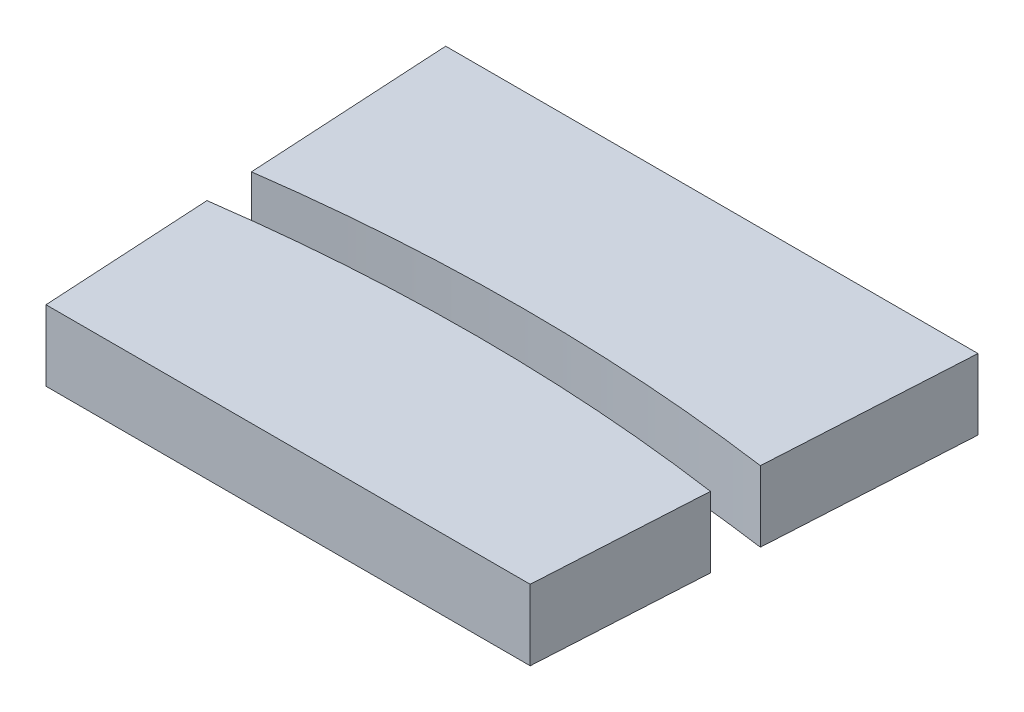
ISO-10303-21;
HEADER;
FILE_DESCRIPTION(('STEP AP214'),'2;1');
FILE_NAME('part.step','',(''),(''),'','','');
FILE_SCHEMA(('AUTOMOTIVE_DESIGN { 1 0 10303 214 1 1 1 1 }'));
ENDSEC;
DATA;
#1=APPLICATION_CONTEXT('core data for automotive mechanical design processes');
#2=APPLICATION_PROTOCOL_DEFINITION('international standard','automotive_design',2000,#1);
#3=PRODUCT_CONTEXT('',#1,'mechanical');
#4=PRODUCT('Part','Part','',(#3));
#5=PRODUCT_RELATED_PRODUCT_CATEGORY('part','',(#4));
#6=PRODUCT_DEFINITION_FORMATION('','',#4);
#7=PRODUCT_DEFINITION_CONTEXT('part definition',#1,'design');
#8=PRODUCT_DEFINITION('design','',#6,#7);
#9=PRODUCT_DEFINITION_SHAPE('','',#8);
#10=(LENGTH_UNIT() NAMED_UNIT(*) SI_UNIT(.MILLI.,.METRE.));
#11=(NAMED_UNIT(*) PLANE_ANGLE_UNIT() SI_UNIT($,.RADIAN.));
#12=(NAMED_UNIT(*) SI_UNIT($,.STERADIAN.) SOLID_ANGLE_UNIT());
#13=UNCERTAINTY_MEASURE_WITH_UNIT(LENGTH_MEASURE(1.E-05),#10,'distance_accuracy_value','');
#14=(GEOMETRIC_REPRESENTATION_CONTEXT(3) GLOBAL_UNCERTAINTY_ASSIGNED_CONTEXT((#13)) GLOBAL_UNIT_ASSIGNED_CONTEXT((#10,
#11,#12)) REPRESENTATION_CONTEXT('',''));
#15=CARTESIAN_POINT('',(0.,0.,0.));
#16=DIRECTION('',(0.,0.,1.));
#17=DIRECTION('',(1.,0.,0.));
#18=AXIS2_PLACEMENT_3D('',#15,#16,#17);
#19=CARTESIAN_POINT('',(-11.5899552235731,3.,-91.5));
#20=DIRECTION('',(0.998391670557349,0.,-0.0566927875633778));
#21=DIRECTION('',(-0.0566927875633778,0.,-0.998391670557349));
#22=AXIS2_PLACEMENT_3D('',#19,#20,#21);
#23=PLANE('',#22);
#24=DIRECTION('',(0.0566927875633778,0.,0.998391670557349));
#25=VECTOR('',#24,1.);
#26=CARTESIAN_POINT('',(-11.5899552235731,0.,-91.5));
#27=LINE('',#26,#25);
#28=CARTESIAN_POINT('',(-11.3060346479351,0.,-86.5));
#29=VERTEX_POINT('',#28);
#30=CARTESIAN_POINT('',(-10.8093001813665,0.,-77.7522284541678));
#31=VERTEX_POINT('',#30);
#32=EDGE_CURVE('E102',#29,#31,#27,.T.);
#33=ORIENTED_EDGE('',*,*,#32,.T.);
#34=DIRECTION('',(0.,1.,0.));
#35=VECTOR('',#34,1.);
#36=CARTESIAN_POINT('',(-10.8093001813665,0.,-77.7522284541679));
#37=LINE('',#36,#35);
#38=CARTESIAN_POINT('',(-10.8093001813665,3.,-77.7522284541678));
#39=VERTEX_POINT('',#38);
#40=EDGE_CURVE('E58',#31,#39,#37,.T.);
#41=ORIENTED_EDGE('',*,*,#40,.T.);
#42=DIRECTION('',(0.0566927875633778,0.,0.998391670557349));
#43=VECTOR('',#42,1.);
#44=CARTESIAN_POINT('',(-11.5899552235731,3.,-91.5));
#45=LINE('',#44,#43);
#46=CARTESIAN_POINT('',(-11.3060346479351,3.,-86.5));
#47=VERTEX_POINT('',#46);
#48=EDGE_CURVE('E104',#47,#39,#45,.T.);
#49=ORIENTED_EDGE('',*,*,#48,.F.);
#50=DIRECTION('',(0.,1.,0.));
#51=VECTOR('',#50,1.);
#52=CARTESIAN_POINT('',(-11.3060346479351,0.,-86.5));
#53=LINE('',#52,#51);
#54=EDGE_CURVE('E50',#29,#47,#53,.T.);
#55=ORIENTED_EDGE('',*,*,#54,.F.);
#56=EDGE_LOOP('',(#33,#41,#49,#55));
#57=FACE_BOUND('',#56,.T.);
#58=ADVANCED_FACE('F42',(#57),#23,.F.);
#59=CARTESIAN_POINT('',(0.,3.,0.));
#60=DIRECTION('',(0.,-1.,0.));
#61=DIRECTION('',(0.,0.,-1.));
#62=AXIS2_PLACEMENT_3D('',#59,#60,#61);
#63=PLANE('',#62);
#64=ORIENTED_EDGE('',*,*,#48,.T.);
#65=CARTESIAN_POINT('',(0.,3.,0.));
#66=DIRECTION('',(0.,-1.,0.));
#67=DIRECTION('',(0.,0.,-1.));
#68=AXIS2_PLACEMENT_3D('',#65,#66,#67);
#69=CIRCLE('',#68,78.5);
#70=CARTESIAN_POINT('',(10.8093001813665,3.000006,-77.7522284541678));
#71=VERTEX_POINT('',#70);
#72=EDGE_CURVE('E62',#39,#71,#69,.T.);
#73=ORIENTED_EDGE('',*,*,#72,.T.);
#74=DIRECTION('',(-0.0566927875633778,0.,0.998391670557349));
#75=VECTOR('',#74,1.);
#76=CARTESIAN_POINT('',(11.5899552235731,3.,-91.5));
#77=LINE('',#76,#75);
#78=CARTESIAN_POINT('',(11.3060346479351,3.,-86.5));
#79=VERTEX_POINT('',#78);
#80=EDGE_CURVE('E95',#79,#71,#77,.T.);
#81=ORIENTED_EDGE('',*,*,#80,.F.);
#82=DIRECTION('',(-1.,0.,0.));
#83=VECTOR('',#82,1.);
#84=CARTESIAN_POINT('',(0.,3.,-86.5));
#85=LINE('',#84,#83);
#86=EDGE_CURVE('E86',#79,#47,#85,.T.);
#87=ORIENTED_EDGE('',*,*,#86,.T.);
#88=EDGE_LOOP('',(#64,#73,#81,#87));
#89=FACE_BOUND('',#88,.T.);
#90=ADVANCED_FACE('F121',(#89),#63,.F.);
#91=CARTESIAN_POINT('',(0.,0.,0.));
#92=DIRECTION('',(0.,-1.,0.));
#93=DIRECTION('',(0.,0.,-1.));
#94=AXIS2_PLACEMENT_3D('',#91,#92,#93);
#95=PLANE('',#94);
#96=CARTESIAN_POINT('',(0.,0.,0.));
#97=DIRECTION('',(0.,1.,0.));
#98=DIRECTION('',(0.,0.,-1.));
#99=AXIS2_PLACEMENT_3D('',#96,#97,#98);
#100=CIRCLE('',#99,78.5);
#101=CARTESIAN_POINT('',(10.8093001813665,0.,-77.7522284541678));
#102=VERTEX_POINT('',#101);
#103=EDGE_CURVE('E78',#102,#31,#100,.T.);
#104=ORIENTED_EDGE('',*,*,#103,.T.);
#105=ORIENTED_EDGE('',*,*,#32,.F.);
#106=DIRECTION('',(1.,0.,0.));
#107=VECTOR('',#106,1.);
#108=CARTESIAN_POINT('',(0.,0.,-86.5));
#109=LINE('',#108,#107);
#110=CARTESIAN_POINT('',(11.3060346479351,0.,-86.5));
#111=VERTEX_POINT('',#110);
#112=EDGE_CURVE('E85',#29,#111,#109,.T.);
#113=ORIENTED_EDGE('',*,*,#112,.T.);
#114=DIRECTION('',(-0.0566927875633778,0.,0.998391670557349));
#115=VECTOR('',#114,1.);
#116=CARTESIAN_POINT('',(11.5899552235731,0.,-91.5));
#117=LINE('',#116,#115);
#118=EDGE_CURVE('E93',#111,#102,#117,.T.);
#119=ORIENTED_EDGE('',*,*,#118,.T.);
#120=EDGE_LOOP('',(#104,#105,#113,#119));
#121=FACE_BOUND('',#120,.T.);
#122=ADVANCED_FACE('F96',(#121),#95,.T.);
#123=CARTESIAN_POINT('',(11.5899552235731,3.,-91.5));
#124=DIRECTION('',(-0.998391670557349,0.,-0.0566927875633778));
#125=DIRECTION('',(0.0566927875633778,0.,-0.998391670557349));
#126=AXIS2_PLACEMENT_3D('',#123,#124,#125);
#127=PLANE('',#126);
#128=ORIENTED_EDGE('',*,*,#80,.T.);
#129=DIRECTION('',(0.,1.,0.));
#130=VECTOR('',#129,1.);
#131=CARTESIAN_POINT('',(10.8093001813665,0.,-77.7522284541678));
#132=LINE('',#131,#130);
#133=EDGE_CURVE('E12',#102,#71,#132,.T.);
#134=ORIENTED_EDGE('',*,*,#133,.F.);
#135=ORIENTED_EDGE('',*,*,#118,.F.);
#136=DIRECTION('',(0.,1.,0.));
#137=VECTOR('',#136,1.);
#138=CARTESIAN_POINT('',(11.3060346479351,0.,-86.5));
#139=LINE('',#138,#137);
#140=EDGE_CURVE('E98',#111,#79,#139,.T.);
#141=ORIENTED_EDGE('',*,*,#140,.T.);
#142=EDGE_LOOP('',(#128,#134,#135,#141));
#143=FACE_BOUND('',#142,.T.);
#144=ADVANCED_FACE('F91',(#143),#127,.F.);
#145=CARTESIAN_POINT('',(0.,0.,-86.5));
#146=DIRECTION('',(0.,0.,1.));
#147=DIRECTION('',(1.,0.,0.));
#148=AXIS2_PLACEMENT_3D('',#145,#146,#147);
#149=PLANE('',#148);
#150=ORIENTED_EDGE('',*,*,#86,.F.);
#151=ORIENTED_EDGE('',*,*,#140,.F.);
#152=ORIENTED_EDGE('',*,*,#112,.F.);
#153=ORIENTED_EDGE('',*,*,#54,.T.);
#154=EDGE_LOOP('',(#150,#151,#152,#153));
#155=FACE_BOUND('',#154,.T.);
#156=ADVANCED_FACE('F118',(#155),#149,.F.);
#157=CARTESIAN_POINT('',(0.,0.,0.));
#158=DIRECTION('',(0.,1.,0.));
#159=DIRECTION('',(0.,0.,1.));
#160=AXIS2_PLACEMENT_3D('',#157,#158,#159);
#161=CYLINDRICAL_SURFACE('',#160,78.5);
#162=ORIENTED_EDGE('',*,*,#103,.F.);
#163=ORIENTED_EDGE('',*,*,#133,.T.);
#164=ORIENTED_EDGE('',*,*,#72,.F.);
#165=ORIENTED_EDGE('',*,*,#40,.F.);
#166=EDGE_LOOP('',(#162,#163,#164,#165));
#167=FACE_BOUND('',#166,.T.);
#168=ADVANCED_FACE('F80',(#167),#161,.F.);
#169=CLOSED_SHELL('',(#58,#90,#122,#144,#156,#168));
#170=MANIFOLD_SOLID_BREP('B2',#169);
#171=CARTESIAN_POINT('',(-10.2839205756381,0.,-68.5));
#172=DIRECTION('',(0.,0.,-1.));
#173=DIRECTION('',(-1.,0.,0.));
#174=AXIS2_PLACEMENT_3D('',#171,#172,#173);
#175=PLANE('',#174);
#176=DIRECTION('',(0.,1.,0.));
#177=VECTOR('',#176,1.);
#178=CARTESIAN_POINT('',(-10.2839205756381,0.,-68.5));
#179=LINE('',#178,#177);
#180=CARTESIAN_POINT('',(-10.2839205756381,0.,-68.5));
#181=VERTEX_POINT('',#180);
#182=CARTESIAN_POINT('',(-10.2839205756381,3.,-68.5));
#183=VERTEX_POINT('',#182);
#184=EDGE_CURVE('E239',#181,#183,#179,.T.);
#185=ORIENTED_EDGE('',*,*,#184,.F.);
#186=DIRECTION('',(-1.,0.,0.));
#187=VECTOR('',#186,1.);
#188=CARTESIAN_POINT('',(-10.2839205756381,0.,-68.5));
#189=LINE('',#188,#187);
#190=CARTESIAN_POINT('',(10.2839205756381,0.,-68.5));
#191=VERTEX_POINT('',#190);
#192=EDGE_CURVE('E229',#191,#181,#189,.T.);
#193=ORIENTED_EDGE('',*,*,#192,.F.);
#194=DIRECTION('',(0.,1.,0.));
#195=VECTOR('',#194,1.);
#196=CARTESIAN_POINT('',(10.2839205756381,0.,-68.5));
#197=LINE('',#196,#195);
#198=CARTESIAN_POINT('',(10.2839205756381,3.,-68.5));
#199=VERTEX_POINT('',#198);
#200=EDGE_CURVE('E234',#191,#199,#197,.T.);
#201=ORIENTED_EDGE('',*,*,#200,.T.);
#202=DIRECTION('',(1.,0.,0.));
#203=VECTOR('',#202,1.);
#204=CARTESIAN_POINT('',(0.,3.,-68.5));
#205=LINE('',#204,#203);
#206=EDGE_CURVE('E250',#183,#199,#205,.T.);
#207=ORIENTED_EDGE('',*,*,#206,.F.);
#208=EDGE_LOOP('',(#185,#193,#201,#207));
#209=FACE_BOUND('',#208,.T.);
#210=ADVANCED_FACE('F181',(#209),#175,.F.);
#211=CARTESIAN_POINT('',(11.5899552235731,3.,-91.5));
#212=DIRECTION('',(-0.998391670557349,0.,-0.0566927875633778));
#213=DIRECTION('',(0.0566927875633778,0.,-0.998391670557349));
#214=AXIS2_PLACEMENT_3D('',#211,#212,#213);
#215=PLANE('',#214);
#216=DIRECTION('',(-0.0566927875633778,0.,0.998391670557349));
#217=VECTOR('',#216,1.);
#218=CARTESIAN_POINT('',(11.5899552235731,0.,-91.5));
#219=LINE('',#218,#217);
#220=CARTESIAN_POINT('',(10.6955278920303,0.,-75.7486348597174));
#221=VERTEX_POINT('',#220);
#222=EDGE_CURVE('E226',#221,#191,#219,.T.);
#223=ORIENTED_EDGE('',*,*,#222,.F.);
#224=DIRECTION('',(0.,1.,0.));
#225=VECTOR('',#224,1.);
#226=CARTESIAN_POINT('',(10.6955278920303,0.,-75.7486348597174));
#227=LINE('',#226,#225);
#228=CARTESIAN_POINT('',(10.6955278920303,3.,-75.7486348597174));
#229=VERTEX_POINT('',#228);
#230=EDGE_CURVE('E219',#221,#229,#227,.T.);
#231=ORIENTED_EDGE('',*,*,#230,.T.);
#232=DIRECTION('',(-0.0566927875633778,0.,0.998391670557349));
#233=VECTOR('',#232,1.);
#234=CARTESIAN_POINT('',(11.5899552235731,3.,-91.5));
#235=LINE('',#234,#233);
#236=EDGE_CURVE('E233',#229,#199,#235,.T.);
#237=ORIENTED_EDGE('',*,*,#236,.T.);
#238=ORIENTED_EDGE('',*,*,#200,.F.);
#239=EDGE_LOOP('',(#223,#231,#237,#238));
#240=FACE_BOUND('',#239,.T.);
#241=ADVANCED_FACE('F241',(#240),#215,.F.);
#242=CARTESIAN_POINT('',(0.,0.,0.));
#243=DIRECTION('',(0.,-1.,0.));
#244=DIRECTION('',(0.,0.,-1.));
#245=AXIS2_PLACEMENT_3D('',#242,#243,#244);
#246=PLANE('',#245);
#247=CARTESIAN_POINT('',(0.,0.,0.));
#248=DIRECTION('',(0.,-1.,0.));
#249=DIRECTION('',(0.,0.,-1.));
#250=AXIS2_PLACEMENT_3D('',#247,#248,#249);
#251=CIRCLE('',#250,76.5);
#252=CARTESIAN_POINT('',(-10.6955278920303,0.,-75.7486348597175));
#253=VERTEX_POINT('',#252);
#254=EDGE_CURVE('E230',#253,#221,#251,.T.);
#255=ORIENTED_EDGE('',*,*,#254,.T.);
#256=ORIENTED_EDGE('',*,*,#222,.T.);
#257=ORIENTED_EDGE('',*,*,#192,.T.);
#258=DIRECTION('',(0.0566927875633778,0.,0.998391670557349));
#259=VECTOR('',#258,1.);
#260=CARTESIAN_POINT('',(-11.5899552235731,0.,-91.5));
#261=LINE('',#260,#259);
#262=EDGE_CURVE('E190',#253,#181,#261,.T.);
#263=ORIENTED_EDGE('',*,*,#262,.F.);
#264=EDGE_LOOP('',(#255,#256,#257,#263));
#265=FACE_BOUND('',#264,.T.);
#266=ADVANCED_FACE('F228',(#265),#246,.T.);
#267=CARTESIAN_POINT('',(0.,3.,0.));
#268=DIRECTION('',(0.,-1.,0.));
#269=DIRECTION('',(0.,0.,-1.));
#270=AXIS2_PLACEMENT_3D('',#267,#268,#269);
#271=PLANE('',#270);
#272=ORIENTED_EDGE('',*,*,#236,.F.);
#273=CARTESIAN_POINT('',(0.,3.,0.));
#274=DIRECTION('',(0.,1.,0.));
#275=DIRECTION('',(0.,0.,1.));
#276=AXIS2_PLACEMENT_3D('',#273,#274,#275);
#277=CIRCLE('',#276,76.5);
#278=CARTESIAN_POINT('',(-10.6955278920303,3.,-75.7486348597174));
#279=VERTEX_POINT('',#278);
#280=EDGE_CURVE('E185',#279,#229,#277,.F.);
#281=ORIENTED_EDGE('',*,*,#280,.F.);
#282=DIRECTION('',(0.0566927875633778,0.,0.998391670557349));
#283=VECTOR('',#282,1.);
#284=CARTESIAN_POINT('',(-11.5899552235731,3.,-91.5));
#285=LINE('',#284,#283);
#286=EDGE_CURVE('E40',#279,#183,#285,.T.);
#287=ORIENTED_EDGE('',*,*,#286,.T.);
#288=ORIENTED_EDGE('',*,*,#206,.T.);
#289=EDGE_LOOP('',(#272,#281,#287,#288));
#290=FACE_BOUND('',#289,.T.);
#291=ADVANCED_FACE('F252',(#290),#271,.F.);
#292=CARTESIAN_POINT('',(-11.5899552235731,3.,-91.5));
#293=DIRECTION('',(0.998391670557349,0.,-0.0566927875633778));
#294=DIRECTION('',(-0.0566927875633778,0.,-0.998391670557349));
#295=AXIS2_PLACEMENT_3D('',#292,#293,#294);
#296=PLANE('',#295);
#297=ORIENTED_EDGE('',*,*,#286,.F.);
#298=DIRECTION('',(0.,1.,0.));
#299=VECTOR('',#298,1.);
#300=CARTESIAN_POINT('',(-10.6955278920303,0.,-75.7486348597175));
#301=LINE('',#300,#299);
#302=EDGE_CURVE('E214',#253,#279,#301,.T.);
#303=ORIENTED_EDGE('',*,*,#302,.F.);
#304=ORIENTED_EDGE('',*,*,#262,.T.);
#305=ORIENTED_EDGE('',*,*,#184,.T.);
#306=EDGE_LOOP('',(#297,#303,#304,#305));
#307=FACE_BOUND('',#306,.T.);
#308=ADVANCED_FACE('F183',(#307),#296,.F.);
#309=CARTESIAN_POINT('',(0.,0.,0.));
#310=DIRECTION('',(0.,1.,0.));
#311=DIRECTION('',(0.,0.,1.));
#312=AXIS2_PLACEMENT_3D('',#309,#310,#311);
#313=CYLINDRICAL_SURFACE('',#312,76.5);
#314=ORIENTED_EDGE('',*,*,#230,.F.);
#315=ORIENTED_EDGE('',*,*,#254,.F.);
#316=ORIENTED_EDGE('',*,*,#302,.T.);
#317=ORIENTED_EDGE('',*,*,#280,.T.);
#318=EDGE_LOOP('',(#314,#315,#316,#317));
#319=FACE_BOUND('',#318,.T.);
#320=ADVANCED_FACE('F256',(#319),#313,.T.);
#321=CLOSED_SHELL('',(#210,#241,#266,#291,#308,#320));
#322=MANIFOLD_SOLID_BREP('B6',#321);
#323=ADVANCED_BREP_SHAPE_REPRESENTATION('',(#18,#170,#322),#14);
#324=SHAPE_DEFINITION_REPRESENTATION(#9,#323);
ENDSEC;
END-ISO-10303-21;
